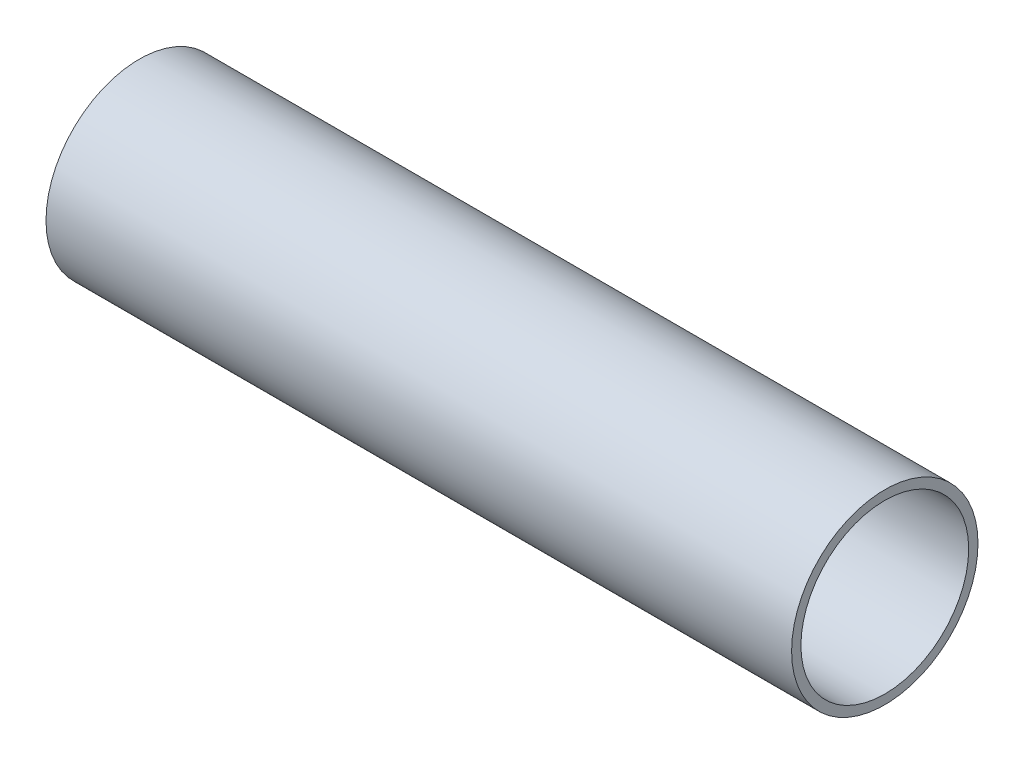
ISO-10303-21;
HEADER;
FILE_DESCRIPTION(('STEP AP214'),'2;1');
FILE_NAME('part.step','',(''),(''),'','','');
FILE_SCHEMA(('AUTOMOTIVE_DESIGN { 1 0 10303 214 1 1 1 1 }'));
ENDSEC;
DATA;
#1=APPLICATION_CONTEXT('core data for automotive mechanical design processes');
#2=APPLICATION_PROTOCOL_DEFINITION('international standard','automotive_design',2000,#1);
#3=PRODUCT_CONTEXT('',#1,'mechanical');
#4=PRODUCT('Part','Part','',(#3));
#5=PRODUCT_RELATED_PRODUCT_CATEGORY('part','',(#4));
#6=PRODUCT_DEFINITION_FORMATION('','',#4);
#7=PRODUCT_DEFINITION_CONTEXT('part definition',#1,'design');
#8=PRODUCT_DEFINITION('design','',#6,#7);
#9=PRODUCT_DEFINITION_SHAPE('','',#8);
#10=(LENGTH_UNIT() NAMED_UNIT(*) SI_UNIT(.MILLI.,.METRE.));
#11=(NAMED_UNIT(*) PLANE_ANGLE_UNIT() SI_UNIT($,.RADIAN.));
#12=(NAMED_UNIT(*) SI_UNIT($,.STERADIAN.) SOLID_ANGLE_UNIT());
#13=UNCERTAINTY_MEASURE_WITH_UNIT(LENGTH_MEASURE(1.E-05),#10,'distance_accuracy_value','');
#14=(GEOMETRIC_REPRESENTATION_CONTEXT(3) GLOBAL_UNCERTAINTY_ASSIGNED_CONTEXT((#13)) GLOBAL_UNIT_ASSIGNED_CONTEXT((#10,
#11,#12)) REPRESENTATION_CONTEXT('',''));
#15=CARTESIAN_POINT('',(0.,0.,0.));
#16=DIRECTION('',(0.,0.,1.));
#17=DIRECTION('',(1.,0.,0.));
#18=AXIS2_PLACEMENT_3D('',#15,#16,#17);
#19=CARTESIAN_POINT('',(50.8,0.,0.));
#20=DIRECTION('',(-1.,0.,0.));
#21=DIRECTION('',(0.,0.,1.));
#22=AXIS2_PLACEMENT_3D('',#19,#20,#21);
#23=CYLINDRICAL_SURFACE('',#22,6.35);
#24=CARTESIAN_POINT('',(50.8,0.,0.));
#25=DIRECTION('',(1.,0.,0.));
#26=DIRECTION('',(0.,0.,-1.));
#27=AXIS2_PLACEMENT_3D('',#24,#25,#26);
#28=CIRCLE('',#27,6.35);
#29=CARTESIAN_POINT('',(50.8,0.,-6.35));
#30=VERTEX_POINT('',#29);
#31=EDGE_CURVE('E10',#30,#30,#28,.T.);
#32=ORIENTED_EDGE('',*,*,#31,.F.);
#33=EDGE_LOOP('',(#32));
#34=FACE_BOUND('',#33,.T.);
#35=CARTESIAN_POINT('',(0.,0.,0.));
#36=DIRECTION('',(1.,0.,0.));
#37=DIRECTION('',(0.,0.,-1.));
#38=AXIS2_PLACEMENT_3D('',#35,#36,#37);
#39=CIRCLE('',#38,6.35);
#40=CARTESIAN_POINT('',(0.,0.,-6.35));
#41=VERTEX_POINT('',#40);
#42=EDGE_CURVE('E34',#41,#41,#39,.T.);
#43=ORIENTED_EDGE('',*,*,#42,.T.);
#44=EDGE_LOOP('',(#43));
#45=FACE_BOUND('',#44,.T.);
#46=ADVANCED_FACE('F31',(#34,#45),#23,.T.);
#47=CARTESIAN_POINT('',(50.8,0.,0.));
#48=DIRECTION('',(1.,0.,0.));
#49=DIRECTION('',(0.,0.,-1.));
#50=AXIS2_PLACEMENT_3D('',#47,#48,#49);
#51=PLANE('',#50);
#52=CARTESIAN_POINT('',(50.8,0.,0.));
#53=DIRECTION('',(1.,0.,0.));
#54=DIRECTION('',(0.,0.,-1.));
#55=AXIS2_PLACEMENT_3D('',#52,#53,#54);
#56=CIRCLE('',#55,5.715);
#57=CARTESIAN_POINT('',(50.8,0.,-5.715));
#58=VERTEX_POINT('',#57);
#59=EDGE_CURVE('E43',#58,#58,#56,.T.);
#60=ORIENTED_EDGE('',*,*,#59,.F.);
#61=EDGE_LOOP('',(#60));
#62=FACE_BOUND('',#61,.T.);
#63=ORIENTED_EDGE('',*,*,#31,.T.);
#64=EDGE_LOOP('',(#63));
#65=FACE_BOUND('',#64,.T.);
#66=ADVANCED_FACE('F58',(#62,#65),#51,.T.);
#67=CARTESIAN_POINT('',(0.,0.,0.));
#68=DIRECTION('',(1.,0.,0.));
#69=DIRECTION('',(0.,0.,-1.));
#70=AXIS2_PLACEMENT_3D('',#67,#68,#69);
#71=PLANE('',#70);
#72=CARTESIAN_POINT('',(0.,0.,0.));
#73=DIRECTION('',(1.,0.,0.));
#74=DIRECTION('',(0.,0.,-1.));
#75=AXIS2_PLACEMENT_3D('',#72,#73,#74);
#76=CIRCLE('',#75,5.715);
#77=CARTESIAN_POINT('',(0.,0.,-5.715));
#78=VERTEX_POINT('',#77);
#79=EDGE_CURVE('E41',#78,#78,#76,.T.);
#80=ORIENTED_EDGE('',*,*,#79,.T.);
#81=EDGE_LOOP('',(#80));
#82=FACE_BOUND('',#81,.T.);
#83=ORIENTED_EDGE('',*,*,#42,.F.);
#84=EDGE_LOOP('',(#83));
#85=FACE_BOUND('',#84,.T.);
#86=ADVANCED_FACE('F49',(#82,#85),#71,.F.);
#87=CARTESIAN_POINT('',(0.,0.,0.));
#88=DIRECTION('',(1.,0.,0.));
#89=DIRECTION('',(0.,0.,-1.));
#90=AXIS2_PLACEMENT_3D('',#87,#88,#89);
#91=CYLINDRICAL_SURFACE('',#90,5.715);
#92=ORIENTED_EDGE('',*,*,#79,.F.);
#93=EDGE_LOOP('',(#92));
#94=FACE_BOUND('',#93,.T.);
#95=ORIENTED_EDGE('',*,*,#59,.T.);
#96=EDGE_LOOP('',(#95));
#97=FACE_BOUND('',#96,.T.);
#98=ADVANCED_FACE('F52',(#94,#97),#91,.F.);
#99=CLOSED_SHELL('',(#46,#66,#86,#98));
#100=MANIFOLD_SOLID_BREP('B2',#99);
#101=ADVANCED_BREP_SHAPE_REPRESENTATION('',(#18,#100),#14);
#102=SHAPE_DEFINITION_REPRESENTATION(#9,#101);
ENDSEC;
END-ISO-10303-21;
